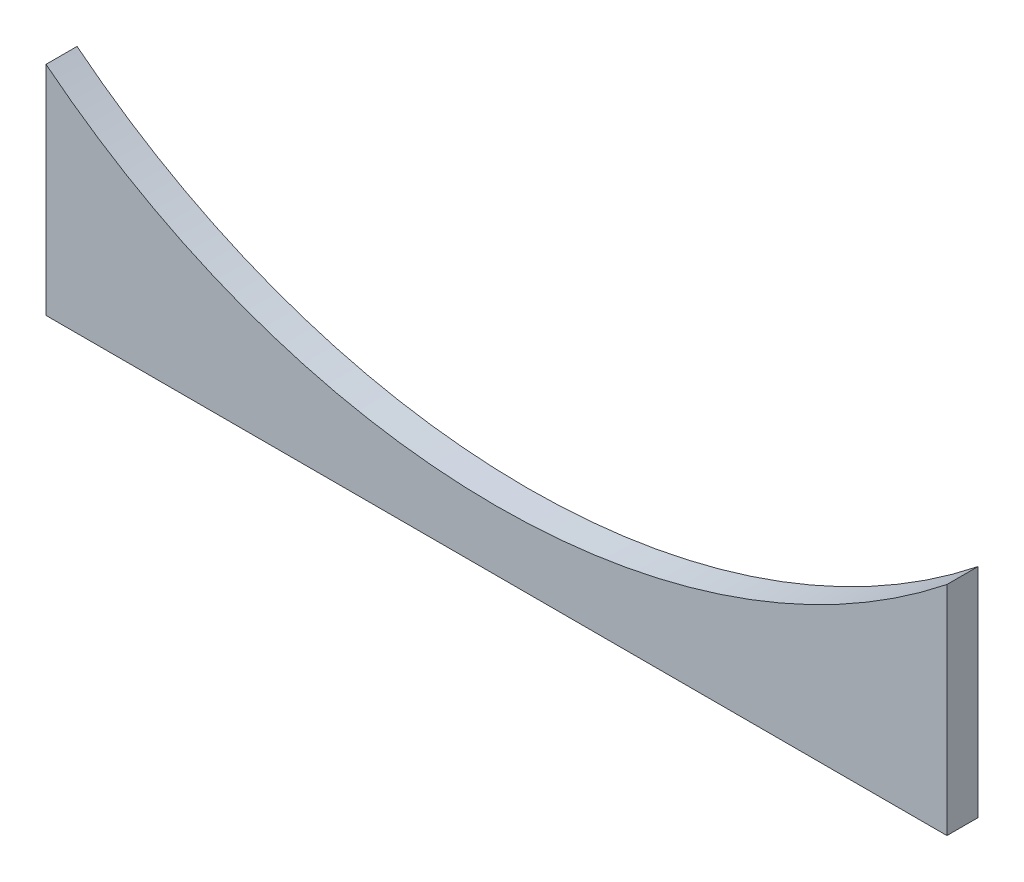
ISO-10303-21;
HEADER;
FILE_DESCRIPTION(('STEP AP214'),'2;1');
FILE_NAME('part.step','',(''),(''),'','','');
FILE_SCHEMA(('AUTOMOTIVE_DESIGN { 1 0 10303 214 1 1 1 1 }'));
ENDSEC;
DATA;
#1=APPLICATION_CONTEXT('core data for automotive mechanical design processes');
#2=APPLICATION_PROTOCOL_DEFINITION('international standard','automotive_design',2000,#1);
#3=PRODUCT_CONTEXT('',#1,'mechanical');
#4=PRODUCT('Part','Part','',(#3));
#5=PRODUCT_RELATED_PRODUCT_CATEGORY('part','',(#4));
#6=PRODUCT_DEFINITION_FORMATION('','',#4);
#7=PRODUCT_DEFINITION_CONTEXT('part definition',#1,'design');
#8=PRODUCT_DEFINITION('design','',#6,#7);
#9=PRODUCT_DEFINITION_SHAPE('','',#8);
#10=(LENGTH_UNIT() NAMED_UNIT(*) SI_UNIT(.MILLI.,.METRE.));
#11=(NAMED_UNIT(*) PLANE_ANGLE_UNIT() SI_UNIT($,.RADIAN.));
#12=(NAMED_UNIT(*) SI_UNIT($,.STERADIAN.) SOLID_ANGLE_UNIT());
#13=UNCERTAINTY_MEASURE_WITH_UNIT(LENGTH_MEASURE(1.E-05),#10,'distance_accuracy_value','');
#14=(GEOMETRIC_REPRESENTATION_CONTEXT(3) GLOBAL_UNCERTAINTY_ASSIGNED_CONTEXT((#13)) GLOBAL_UNIT_ASSIGNED_CONTEXT((#10,
#11,#12)) REPRESENTATION_CONTEXT('',''));
#15=CARTESIAN_POINT('',(0.,0.,0.));
#16=DIRECTION('',(0.,0.,1.));
#17=DIRECTION('',(1.,0.,0.));
#18=AXIS2_PLACEMENT_3D('',#15,#16,#17);
#19=CARTESIAN_POINT('',(0.,0.,6.35));
#20=DIRECTION('',(0.,0.,1.));
#21=DIRECTION('',(1.,0.,0.));
#22=AXIS2_PLACEMENT_3D('',#19,#20,#21);
#23=PLANE('',#22);
#24=DIRECTION('',(0.,1.,0.));
#25=VECTOR('',#24,1.);
#26=CARTESIAN_POINT('',(92.075,-22.225,6.35));
#27=LINE('',#26,#25);
#28=CARTESIAN_POINT('',(92.075,-22.225,6.35));
#29=VERTEX_POINT('',#28);
#30=CARTESIAN_POINT('',(92.075,22.225,6.35));
#31=VERTEX_POINT('',#30);
#32=EDGE_CURVE('E89',#29,#31,#27,.T.);
#33=ORIENTED_EDGE('',*,*,#32,.T.);
#34=CARTESIAN_POINT('',(0.,137.943301309978,6.34999999999999));
#35=DIRECTION('',(0.,0.,1.));
#36=DIRECTION('',(1.,0.,0.));
#37=AXIS2_PLACEMENT_3D('',#34,#35,#36);
#38=CIRCLE('',#37,147.880123353569);
#39=CARTESIAN_POINT('',(-92.075,22.225,6.35));
#40=VERTEX_POINT('',#39);
#41=EDGE_CURVE('E50',#31,#40,#38,.F.);
#42=ORIENTED_EDGE('',*,*,#41,.T.);
#43=DIRECTION('',(0.,-1.,0.));
#44=VECTOR('',#43,1.);
#45=CARTESIAN_POINT('',(-92.075,-22.225,6.35));
#46=LINE('',#45,#44);
#47=CARTESIAN_POINT('',(-92.075,-22.225,6.35));
#48=VERTEX_POINT('',#47);
#49=EDGE_CURVE('E86',#40,#48,#46,.T.);
#50=ORIENTED_EDGE('',*,*,#49,.T.);
#51=DIRECTION('',(1.,0.,0.));
#52=VECTOR('',#51,1.);
#53=CARTESIAN_POINT('',(92.075,-22.225,6.35));
#54=LINE('',#53,#52);
#55=EDGE_CURVE('E75',#48,#29,#54,.T.);
#56=ORIENTED_EDGE('',*,*,#55,.T.);
#57=EDGE_LOOP('',(#33,#42,#50,#56));
#58=FACE_BOUND('',#57,.T.);
#59=ADVANCED_FACE('F33',(#58),#23,.T.);
#60=CARTESIAN_POINT('',(0.,0.,0.));
#61=DIRECTION('',(0.,0.,1.));
#62=DIRECTION('',(1.,0.,0.));
#63=AXIS2_PLACEMENT_3D('',#60,#61,#62);
#64=PLANE('',#63);
#65=CARTESIAN_POINT('',(0.,137.943301309978,0.));
#66=DIRECTION('',(0.,0.,1.));
#67=DIRECTION('',(1.,0.,0.));
#68=AXIS2_PLACEMENT_3D('',#65,#66,#67);
#69=CIRCLE('',#68,147.880123353569);
#70=CARTESIAN_POINT('',(92.075,22.225,0.));
#71=VERTEX_POINT('',#70);
#72=CARTESIAN_POINT('',(-92.0750000000001,22.2250000000001,0.));
#73=VERTEX_POINT('',#72);
#74=EDGE_CURVE('E11',#71,#73,#69,.F.);
#75=ORIENTED_EDGE('',*,*,#74,.F.);
#76=DIRECTION('',(0.,1.,0.));
#77=VECTOR('',#76,1.);
#78=CARTESIAN_POINT('',(92.075,-22.225,0.));
#79=LINE('',#78,#77);
#80=CARTESIAN_POINT('',(92.075,-22.225,0.));
#81=VERTEX_POINT('',#80);
#82=EDGE_CURVE('E152',#81,#71,#79,.T.);
#83=ORIENTED_EDGE('',*,*,#82,.F.);
#84=DIRECTION('',(1.,0.,0.));
#85=VECTOR('',#84,1.);
#86=CARTESIAN_POINT('',(92.075,-22.225,0.));
#87=LINE('',#86,#85);
#88=CARTESIAN_POINT('',(-92.075,-22.225,0.));
#89=VERTEX_POINT('',#88);
#90=EDGE_CURVE('E64',#89,#81,#87,.T.);
#91=ORIENTED_EDGE('',*,*,#90,.F.);
#92=DIRECTION('',(0.,-1.,0.));
#93=VECTOR('',#92,1.);
#94=CARTESIAN_POINT('',(-92.075,-22.225,0.));
#95=LINE('',#94,#93);
#96=EDGE_CURVE('E78',#73,#89,#95,.T.);
#97=ORIENTED_EDGE('',*,*,#96,.F.);
#98=EDGE_LOOP('',(#75,#83,#91,#97));
#99=FACE_BOUND('',#98,.T.);
#100=ADVANCED_FACE('F80',(#99),#64,.F.);
#101=CARTESIAN_POINT('',(-92.075,-22.225,6.35));
#102=DIRECTION('',(1.,0.,0.));
#103=DIRECTION('',(0.,0.,-1.));
#104=AXIS2_PLACEMENT_3D('',#101,#102,#103);
#105=PLANE('',#104);
#106=ORIENTED_EDGE('',*,*,#96,.T.);
#107=DIRECTION('',(0.,0.,-1.));
#108=VECTOR('',#107,1.);
#109=CARTESIAN_POINT('',(-92.075,-22.225,6.35));
#110=LINE('',#109,#108);
#111=EDGE_CURVE('E42',#48,#89,#110,.T.);
#112=ORIENTED_EDGE('',*,*,#111,.F.);
#113=ORIENTED_EDGE('',*,*,#49,.F.);
#114=DIRECTION('',(0.,0.,-1.));
#115=VECTOR('',#114,1.);
#116=CARTESIAN_POINT('',(-92.075,22.225,6.35));
#117=LINE('',#116,#115);
#118=EDGE_CURVE('E85',#40,#73,#117,.T.);
#119=ORIENTED_EDGE('',*,*,#118,.T.);
#120=EDGE_LOOP('',(#106,#112,#113,#119));
#121=FACE_BOUND('',#120,.T.);
#122=ADVANCED_FACE('F35',(#121),#105,.F.);
#123=CARTESIAN_POINT('',(92.075,-22.225,6.35));
#124=DIRECTION('',(0.,1.,0.));
#125=DIRECTION('',(-1.,0.,0.));
#126=AXIS2_PLACEMENT_3D('',#123,#124,#125);
#127=PLANE('',#126);
#128=ORIENTED_EDGE('',*,*,#90,.T.);
#129=DIRECTION('',(0.,0.,-1.));
#130=VECTOR('',#129,1.);
#131=CARTESIAN_POINT('',(92.075,-22.225,6.35));
#132=LINE('',#131,#130);
#133=EDGE_CURVE('E96',#29,#81,#132,.T.);
#134=ORIENTED_EDGE('',*,*,#133,.F.);
#135=ORIENTED_EDGE('',*,*,#55,.F.);
#136=ORIENTED_EDGE('',*,*,#111,.T.);
#137=EDGE_LOOP('',(#128,#134,#135,#136));
#138=FACE_BOUND('',#137,.T.);
#139=ADVANCED_FACE('F100',(#138),#127,.F.);
#140=CARTESIAN_POINT('',(92.075,-22.225,6.35));
#141=DIRECTION('',(-1.,0.,0.));
#142=DIRECTION('',(0.,0.,1.));
#143=AXIS2_PLACEMENT_3D('',#140,#141,#142);
#144=PLANE('',#143);
#145=ORIENTED_EDGE('',*,*,#82,.T.);
#146=DIRECTION('',(0.,0.,-1.));
#147=VECTOR('',#146,1.);
#148=CARTESIAN_POINT('',(92.075,22.225,6.35));
#149=LINE('',#148,#147);
#150=EDGE_CURVE('E88',#31,#71,#149,.T.);
#151=ORIENTED_EDGE('',*,*,#150,.F.);
#152=ORIENTED_EDGE('',*,*,#32,.F.);
#153=ORIENTED_EDGE('',*,*,#133,.T.);
#154=EDGE_LOOP('',(#145,#151,#152,#153));
#155=FACE_BOUND('',#154,.T.);
#156=ADVANCED_FACE('F102',(#155),#144,.F.);
#157=CARTESIAN_POINT('',(0.,137.943301309978,251.218883461014));
#158=DIRECTION('',(0.,0.,-1.));
#159=DIRECTION('',(-1.,0.,0.));
#160=AXIS2_PLACEMENT_3D('',#157,#158,#159);
#161=CYLINDRICAL_SURFACE('',#160,147.880123353569);
#162=ORIENTED_EDGE('',*,*,#41,.F.);
#163=ORIENTED_EDGE('',*,*,#150,.T.);
#164=ORIENTED_EDGE('',*,*,#74,.T.);
#165=ORIENTED_EDGE('',*,*,#118,.F.);
#166=EDGE_LOOP('',(#162,#163,#164,#165));
#167=FACE_BOUND('',#166,.T.);
#168=ADVANCED_FACE('F92',(#167),#161,.F.);
#169=CLOSED_SHELL('',(#59,#100,#122,#139,#156,#168));
#170=MANIFOLD_SOLID_BREP('B2',#169);
#171=ADVANCED_BREP_SHAPE_REPRESENTATION('',(#18,#170),#14);
#172=SHAPE_DEFINITION_REPRESENTATION(#9,#171);
ENDSEC;
END-ISO-10303-21;
